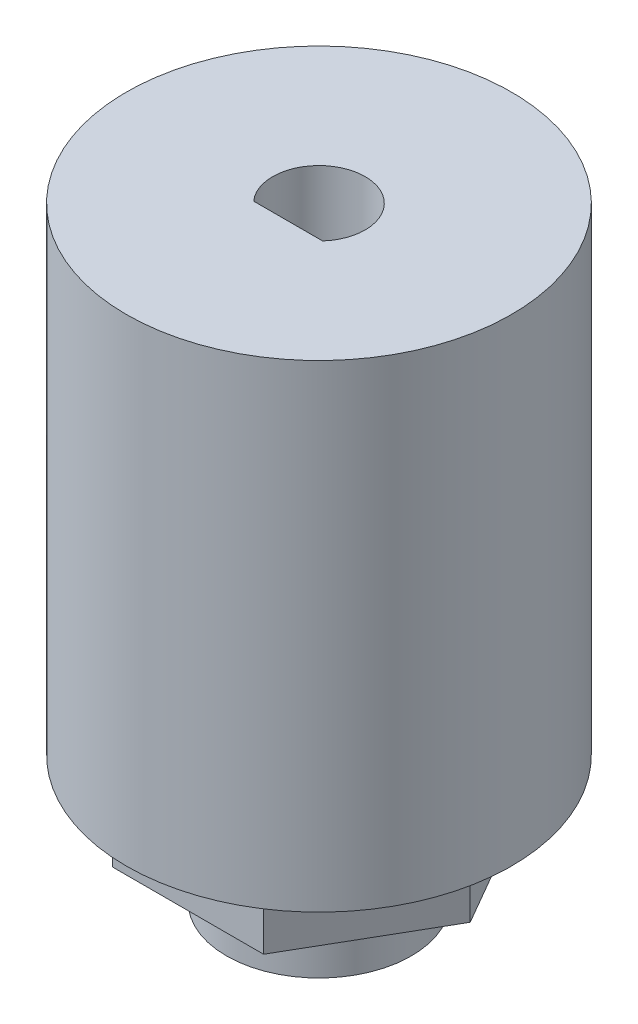
ISO-10303-21;
HEADER;
FILE_DESCRIPTION(('STEP AP214'),'2;1');
FILE_NAME('part.step','',(''),(''),'','','');
FILE_SCHEMA(('AUTOMOTIVE_DESIGN { 1 0 10303 214 1 1 1 1 }'));
ENDSEC;
DATA;
#1=APPLICATION_CONTEXT('core data for automotive mechanical design processes');
#2=APPLICATION_PROTOCOL_DEFINITION('international standard','automotive_design',2000,#1);
#3=PRODUCT_CONTEXT('',#1,'mechanical');
#4=PRODUCT('Part','Part','',(#3));
#5=PRODUCT_RELATED_PRODUCT_CATEGORY('part','',(#4));
#6=PRODUCT_DEFINITION_FORMATION('','',#4);
#7=PRODUCT_DEFINITION_CONTEXT('part definition',#1,'design');
#8=PRODUCT_DEFINITION('design','',#6,#7);
#9=PRODUCT_DEFINITION_SHAPE('','',#8);
#10=(LENGTH_UNIT() NAMED_UNIT(*) SI_UNIT(.MILLI.,.METRE.));
#11=(NAMED_UNIT(*) PLANE_ANGLE_UNIT() SI_UNIT($,.RADIAN.));
#12=(NAMED_UNIT(*) SI_UNIT($,.STERADIAN.) SOLID_ANGLE_UNIT());
#13=UNCERTAINTY_MEASURE_WITH_UNIT(LENGTH_MEASURE(1.E-05),#10,'distance_accuracy_value','');
#14=(GEOMETRIC_REPRESENTATION_CONTEXT(3) GLOBAL_UNCERTAINTY_ASSIGNED_CONTEXT((#13)) GLOBAL_UNIT_ASSIGNED_CONTEXT((#10,
#11,#12)) REPRESENTATION_CONTEXT('',''));
#15=CARTESIAN_POINT('',(0.,0.,0.));
#16=DIRECTION('',(0.,0.,1.));
#17=DIRECTION('',(1.,0.,0.));
#18=AXIS2_PLACEMENT_3D('',#15,#16,#17);
#19=CARTESIAN_POINT('',(0.,0.,2.));
#20=DIRECTION('',(0.,0.,1.));
#21=DIRECTION('',(1.,0.,0.));
#22=AXIS2_PLACEMENT_3D('',#19,#20,#21);
#23=PLANE('',#22);
#24=DIRECTION('',(1.,0.,0.));
#25=VECTOR('',#24,1.);
#26=CARTESIAN_POINT('',(0.,6.,2.));
#27=LINE('',#26,#25);
#28=CARTESIAN_POINT('',(-2.23606797749979,6.,2.));
#29=VERTEX_POINT('',#28);
#30=CARTESIAN_POINT('',(2.23606797749979,6.,2.));
#31=VERTEX_POINT('',#30);
#32=EDGE_CURVE('E51',#29,#31,#27,.T.);
#33=ORIENTED_EDGE('',*,*,#32,.F.);
#34=DIRECTION('',(0.,1.,0.));
#35=VECTOR('',#34,1.);
#36=CARTESIAN_POINT('',(-2.23606797749979,0.,2.));
#37=LINE('',#36,#35);
#38=CARTESIAN_POINT('',(-2.23606797749979,39.3,2.));
#39=VERTEX_POINT('',#38);
#40=EDGE_CURVE('E103',#29,#39,#37,.T.);
#41=ORIENTED_EDGE('',*,*,#40,.T.);
#42=DIRECTION('',(1.,0.,0.));
#43=VECTOR('',#42,1.);
#44=CARTESIAN_POINT('',(0.,39.3,2.));
#45=LINE('',#44,#43);
#46=CARTESIAN_POINT('',(2.23606797749979,39.3,2.));
#47=VERTEX_POINT('',#46);
#48=EDGE_CURVE('E104',#39,#47,#45,.T.);
#49=ORIENTED_EDGE('',*,*,#48,.T.);
#50=DIRECTION('',(0.,1.,0.));
#51=VECTOR('',#50,1.);
#52=CARTESIAN_POINT('',(2.23606797749979,0.,2.));
#53=LINE('',#52,#51);
#54=EDGE_CURVE('E58',#31,#47,#53,.T.);
#55=ORIENTED_EDGE('',*,*,#54,.F.);
#56=EDGE_LOOP('',(#33,#41,#49,#55));
#57=FACE_BOUND('',#56,.T.);
#58=ADVANCED_FACE('F38',(#57),#23,.F.);
#59=CARTESIAN_POINT('',(0.,0.,0.));
#60=DIRECTION('',(0.,1.,0.));
#61=DIRECTION('',(0.,0.,1.));
#62=AXIS2_PLACEMENT_3D('',#59,#60,#61);
#63=CYLINDRICAL_SURFACE('',#62,3.);
#64=CARTESIAN_POINT('',(0.,6.,0.));
#65=DIRECTION('',(0.,-1.,0.));
#66=DIRECTION('',(0.,0.,-1.));
#67=AXIS2_PLACEMENT_3D('',#64,#65,#66);
#68=CIRCLE('',#67,3.);
#69=EDGE_CURVE('E11',#31,#29,#68,.F.);
#70=ORIENTED_EDGE('',*,*,#69,.F.);
#71=ORIENTED_EDGE('',*,*,#54,.T.);
#72=CARTESIAN_POINT('',(0.,39.3,0.));
#73=DIRECTION('',(0.,1.,0.));
#74=DIRECTION('',(0.,0.,1.));
#75=AXIS2_PLACEMENT_3D('',#72,#73,#74);
#76=CIRCLE('',#75,3.);
#77=EDGE_CURVE('E109',#47,#39,#76,.T.);
#78=ORIENTED_EDGE('',*,*,#77,.T.);
#79=ORIENTED_EDGE('',*,*,#40,.F.);
#80=EDGE_LOOP('',(#70,#71,#78,#79));
#81=FACE_BOUND('',#80,.T.);
#82=ADVANCED_FACE('F107',(#81),#63,.F.);
#83=CARTESIAN_POINT('',(0.,3.8,0.));
#84=DIRECTION('',(0.,-1.,0.));
#85=DIRECTION('',(0.,0.,-1.));
#86=AXIS2_PLACEMENT_3D('',#83,#84,#85);
#87=CYLINDRICAL_SURFACE('',#86,6.);
#88=CARTESIAN_POINT('',(0.,3.8,0.));
#89=DIRECTION('',(0.,1.,0.));
#90=DIRECTION('',(0.,0.,1.));
#91=AXIS2_PLACEMENT_3D('',#88,#89,#90);
#92=CIRCLE('',#91,6.);
#93=CARTESIAN_POINT('',(0.,3.8,6.));
#94=VERTEX_POINT('',#93);
#95=EDGE_CURVE('E46',#94,#94,#92,.T.);
#96=ORIENTED_EDGE('',*,*,#95,.F.);
#97=EDGE_LOOP('',(#96));
#98=FACE_BOUND('',#97,.T.);
#99=CARTESIAN_POINT('',(0.,0.,0.));
#100=DIRECTION('',(0.,1.,0.));
#101=DIRECTION('',(0.,0.,1.));
#102=AXIS2_PLACEMENT_3D('',#99,#100,#101);
#103=CIRCLE('',#102,6.);
#104=CARTESIAN_POINT('',(0.,0.,6.));
#105=VERTEX_POINT('',#104);
#106=EDGE_CURVE('E171',#105,#105,#103,.T.);
#107=ORIENTED_EDGE('',*,*,#106,.T.);
#108=EDGE_LOOP('',(#107));
#109=FACE_BOUND('',#108,.T.);
#110=ADVANCED_FACE('F40',(#98,#109),#87,.T.);
#111=CARTESIAN_POINT('',(0.,0.,0.));
#112=DIRECTION('',(0.,1.,0.));
#113=DIRECTION('',(0.,0.,1.));
#114=AXIS2_PLACEMENT_3D('',#111,#112,#113);
#115=PLANE('',#114);
#116=CARTESIAN_POINT('',(0.,0.,0.));
#117=DIRECTION('',(0.,-1.,0.));
#118=DIRECTION('',(0.,0.,-1.));
#119=AXIS2_PLACEMENT_3D('',#116,#117,#118);
#120=CIRCLE('',#119,3.6);
#121=CARTESIAN_POINT('',(0.,0.,-3.6));
#122=VERTEX_POINT('',#121);
#123=EDGE_CURVE('E382',#122,#122,#120,.T.);
#124=ORIENTED_EDGE('',*,*,#123,.F.);
#125=EDGE_LOOP('',(#124));
#126=FACE_BOUND('',#125,.T.);
#127=ORIENTED_EDGE('',*,*,#106,.F.);
#128=EDGE_LOOP('',(#127));
#129=FACE_BOUND('',#128,.T.);
#130=ADVANCED_FACE('F177',(#126,#129),#115,.F.);
#131=CARTESIAN_POINT('',(4.90747728811182,8.3,8.5));
#132=DIRECTION('',(-0.866025403784439,0.,-0.5));
#133=DIRECTION('',(-0.5,0.,0.866025403784439));
#134=AXIS2_PLACEMENT_3D('',#131,#132,#133);
#135=PLANE('',#134);
#136=DIRECTION('',(0.5,0.,-0.866025403784439));
#137=VECTOR('',#136,1.);
#138=CARTESIAN_POINT('',(4.90747728811182,3.8,8.5));
#139=LINE('',#138,#137);
#140=CARTESIAN_POINT('',(4.90747728811182,3.8,8.5));
#141=VERTEX_POINT('',#140);
#142=CARTESIAN_POINT('',(9.81495457622364,3.8,0.));
#143=VERTEX_POINT('',#142);
#144=EDGE_CURVE('E122',#141,#143,#139,.T.);
#145=ORIENTED_EDGE('',*,*,#144,.T.);
#146=DIRECTION('',(0.,-1.,0.));
#147=VECTOR('',#146,1.);
#148=CARTESIAN_POINT('',(9.81495457622364,8.3,0.));
#149=LINE('',#148,#147);
#150=CARTESIAN_POINT('',(9.81495457622364,8.3,0.));
#151=VERTEX_POINT('',#150);
#152=EDGE_CURVE('E168',#151,#143,#149,.T.);
#153=ORIENTED_EDGE('',*,*,#152,.F.);
#154=DIRECTION('',(0.5,0.,-0.866025403784439));
#155=VECTOR('',#154,1.);
#156=CARTESIAN_POINT('',(4.90747728811182,8.3,8.5));
#157=LINE('',#156,#155);
#158=CARTESIAN_POINT('',(4.90747728811182,8.3,8.5));
#159=VERTEX_POINT('',#158);
#160=EDGE_CURVE('E123',#159,#151,#157,.T.);
#161=ORIENTED_EDGE('',*,*,#160,.F.);
#162=DIRECTION('',(0.,-1.,0.));
#163=VECTOR('',#162,1.);
#164=CARTESIAN_POINT('',(4.90747728811182,8.3,8.5));
#165=LINE('',#164,#163);
#166=EDGE_CURVE('E142',#159,#141,#165,.T.);
#167=ORIENTED_EDGE('',*,*,#166,.T.);
#168=EDGE_LOOP('',(#145,#153,#161,#167));
#169=FACE_BOUND('',#168,.T.);
#170=ADVANCED_FACE('F179',(#169),#135,.F.);
#171=CARTESIAN_POINT('',(9.81495457622364,8.3,0.));
#172=DIRECTION('',(-0.866025403784439,0.,0.5));
#173=DIRECTION('',(0.5,0.,0.866025403784439));
#174=AXIS2_PLACEMENT_3D('',#171,#172,#173);
#175=PLANE('',#174);
#176=DIRECTION('',(-0.5,0.,-0.866025403784439));
#177=VECTOR('',#176,1.);
#178=CARTESIAN_POINT('',(9.81495457622364,3.8,0.));
#179=LINE('',#178,#177);
#180=CARTESIAN_POINT('',(4.90747728811182,3.8,-8.5));
#181=VERTEX_POINT('',#180);
#182=EDGE_CURVE('E145',#143,#181,#179,.T.);
#183=ORIENTED_EDGE('',*,*,#182,.T.);
#184=DIRECTION('',(0.,-1.,0.));
#185=VECTOR('',#184,1.);
#186=CARTESIAN_POINT('',(4.90747728811182,8.3,-8.5));
#187=LINE('',#186,#185);
#188=CARTESIAN_POINT('',(4.90747728811182,8.3,-8.5));
#189=VERTEX_POINT('',#188);
#190=EDGE_CURVE('E165',#189,#181,#187,.T.);
#191=ORIENTED_EDGE('',*,*,#190,.F.);
#192=DIRECTION('',(-0.5,0.,-0.866025403784439));
#193=VECTOR('',#192,1.);
#194=CARTESIAN_POINT('',(9.81495457622364,8.3,0.));
#195=LINE('',#194,#193);
#196=EDGE_CURVE('E126',#151,#189,#195,.T.);
#197=ORIENTED_EDGE('',*,*,#196,.F.);
#198=ORIENTED_EDGE('',*,*,#152,.T.);
#199=EDGE_LOOP('',(#183,#191,#197,#198));
#200=FACE_BOUND('',#199,.T.);
#201=ADVANCED_FACE('F185',(#200),#175,.F.);
#202=CARTESIAN_POINT('',(4.90747728811182,8.3,-8.5));
#203=DIRECTION('',(0.,0.,1.));
#204=DIRECTION('',(1.,0.,0.));
#205=AXIS2_PLACEMENT_3D('',#202,#203,#204);
#206=PLANE('',#205);
#207=DIRECTION('',(-1.,0.,0.));
#208=VECTOR('',#207,1.);
#209=CARTESIAN_POINT('',(4.90747728811182,3.8,-8.5));
#210=LINE('',#209,#208);
#211=CARTESIAN_POINT('',(-4.90747728811182,3.8,-8.5));
#212=VERTEX_POINT('',#211);
#213=EDGE_CURVE('E147',#181,#212,#210,.T.);
#214=ORIENTED_EDGE('',*,*,#213,.T.);
#215=DIRECTION('',(0.,-1.,0.));
#216=VECTOR('',#215,1.);
#217=CARTESIAN_POINT('',(-4.90747728811182,8.3,-8.5));
#218=LINE('',#217,#216);
#219=CARTESIAN_POINT('',(-4.90747728811182,8.3,-8.5));
#220=VERTEX_POINT('',#219);
#221=EDGE_CURVE('E162',#220,#212,#218,.T.);
#222=ORIENTED_EDGE('',*,*,#221,.F.);
#223=DIRECTION('',(-1.,0.,0.));
#224=VECTOR('',#223,1.);
#225=CARTESIAN_POINT('',(4.90747728811182,8.3,-8.5));
#226=LINE('',#225,#224);
#227=EDGE_CURVE('E130',#189,#220,#226,.T.);
#228=ORIENTED_EDGE('',*,*,#227,.F.);
#229=ORIENTED_EDGE('',*,*,#190,.T.);
#230=EDGE_LOOP('',(#214,#222,#228,#229));
#231=FACE_BOUND('',#230,.T.);
#232=ADVANCED_FACE('F225',(#231),#206,.F.);
#233=CARTESIAN_POINT('',(-4.90747728811182,8.3,-8.5));
#234=DIRECTION('',(0.866025403784439,0.,0.5));
#235=DIRECTION('',(0.5,0.,-0.866025403784439));
#236=AXIS2_PLACEMENT_3D('',#233,#234,#235);
#237=PLANE('',#236);
#238=DIRECTION('',(-0.5,0.,0.866025403784439));
#239=VECTOR('',#238,1.);
#240=CARTESIAN_POINT('',(-4.90747728811182,3.8,-8.5));
#241=LINE('',#240,#239);
#242=CARTESIAN_POINT('',(-9.81495457622364,3.8,0.));
#243=VERTEX_POINT('',#242);
#244=EDGE_CURVE('E149',#212,#243,#241,.T.);
#245=ORIENTED_EDGE('',*,*,#244,.T.);
#246=DIRECTION('',(0.,-1.,0.));
#247=VECTOR('',#246,1.);
#248=CARTESIAN_POINT('',(-9.81495457622364,8.3,0.));
#249=LINE('',#248,#247);
#250=CARTESIAN_POINT('',(-9.81495457622364,8.3,0.));
#251=VERTEX_POINT('',#250);
#252=EDGE_CURVE('E159',#251,#243,#249,.T.);
#253=ORIENTED_EDGE('',*,*,#252,.F.);
#254=DIRECTION('',(-0.5,0.,0.866025403784439));
#255=VECTOR('',#254,1.);
#256=CARTESIAN_POINT('',(-4.90747728811182,8.3,-8.5));
#257=LINE('',#256,#255);
#258=EDGE_CURVE('E133',#220,#251,#257,.T.);
#259=ORIENTED_EDGE('',*,*,#258,.F.);
#260=ORIENTED_EDGE('',*,*,#221,.T.);
#261=EDGE_LOOP('',(#245,#253,#259,#260));
#262=FACE_BOUND('',#261,.T.);
#263=ADVANCED_FACE('F221',(#262),#237,.F.);
#264=CARTESIAN_POINT('',(-9.81495457622364,8.3,0.));
#265=DIRECTION('',(0.866025403784439,0.,-0.5));
#266=DIRECTION('',(-0.5,0.,-0.866025403784439));
#267=AXIS2_PLACEMENT_3D('',#264,#265,#266);
#268=PLANE('',#267);
#269=DIRECTION('',(0.5,0.,0.866025403784439));
#270=VECTOR('',#269,1.);
#271=CARTESIAN_POINT('',(-9.81495457622364,3.8,0.));
#272=LINE('',#271,#270);
#273=CARTESIAN_POINT('',(-4.90747728811182,3.8,8.5));
#274=VERTEX_POINT('',#273);
#275=EDGE_CURVE('E151',#243,#274,#272,.T.);
#276=ORIENTED_EDGE('',*,*,#275,.T.);
#277=DIRECTION('',(0.,-1.,0.));
#278=VECTOR('',#277,1.);
#279=CARTESIAN_POINT('',(-4.90747728811182,8.3,8.5));
#280=LINE('',#279,#278);
#281=CARTESIAN_POINT('',(-4.90747728811182,8.3,8.5));
#282=VERTEX_POINT('',#281);
#283=EDGE_CURVE('E156',#282,#274,#280,.T.);
#284=ORIENTED_EDGE('',*,*,#283,.F.);
#285=DIRECTION('',(0.5,0.,0.866025403784439));
#286=VECTOR('',#285,1.);
#287=CARTESIAN_POINT('',(-9.81495457622364,8.3,0.));
#288=LINE('',#287,#286);
#289=EDGE_CURVE('E136',#251,#282,#288,.T.);
#290=ORIENTED_EDGE('',*,*,#289,.F.);
#291=ORIENTED_EDGE('',*,*,#252,.T.);
#292=EDGE_LOOP('',(#276,#284,#290,#291));
#293=FACE_BOUND('',#292,.T.);
#294=ADVANCED_FACE('F217',(#293),#268,.F.);
#295=CARTESIAN_POINT('',(-4.90747728811182,8.3,8.5));
#296=DIRECTION('',(0.,0.,-1.));
#297=DIRECTION('',(-1.,0.,0.));
#298=AXIS2_PLACEMENT_3D('',#295,#296,#297);
#299=PLANE('',#298);
#300=DIRECTION('',(1.,0.,0.));
#301=VECTOR('',#300,1.);
#302=CARTESIAN_POINT('',(-4.90747728811182,3.8,8.5));
#303=LINE('',#302,#301);
#304=EDGE_CURVE('E127',#274,#141,#303,.T.);
#305=ORIENTED_EDGE('',*,*,#304,.T.);
#306=ORIENTED_EDGE('',*,*,#166,.F.);
#307=DIRECTION('',(1.,0.,0.));
#308=VECTOR('',#307,1.);
#309=CARTESIAN_POINT('',(-4.90747728811182,8.3,8.5));
#310=LINE('',#309,#308);
#311=EDGE_CURVE('E139',#282,#159,#310,.T.);
#312=ORIENTED_EDGE('',*,*,#311,.F.);
#313=ORIENTED_EDGE('',*,*,#283,.T.);
#314=EDGE_LOOP('',(#305,#306,#312,#313));
#315=FACE_BOUND('',#314,.T.);
#316=ADVANCED_FACE('F213',(#315),#299,.F.);
#317=CARTESIAN_POINT('',(0.,3.8,0.));
#318=DIRECTION('',(0.,1.,0.));
#319=DIRECTION('',(0.,0.,1.));
#320=AXIS2_PLACEMENT_3D('',#317,#318,#319);
#321=PLANE('',#320);
#322=ORIENTED_EDGE('',*,*,#95,.T.);
#323=EDGE_LOOP('',(#322));
#324=FACE_BOUND('',#323,.T.);
#325=ORIENTED_EDGE('',*,*,#144,.F.);
#326=ORIENTED_EDGE('',*,*,#304,.F.);
#327=ORIENTED_EDGE('',*,*,#275,.F.);
#328=ORIENTED_EDGE('',*,*,#244,.F.);
#329=ORIENTED_EDGE('',*,*,#213,.F.);
#330=ORIENTED_EDGE('',*,*,#182,.F.);
#331=EDGE_LOOP('',(#325,#326,#327,#328,#329,#330));
#332=FACE_BOUND('',#331,.T.);
#333=ADVANCED_FACE('F206',(#324,#332),#321,.F.);
#334=CARTESIAN_POINT('',(0.,8.3,0.));
#335=DIRECTION('',(0.,1.,0.));
#336=DIRECTION('',(0.,0.,1.));
#337=AXIS2_PLACEMENT_3D('',#334,#335,#336);
#338=PLANE('',#337);
#339=CARTESIAN_POINT('',(0.,8.3,0.));
#340=DIRECTION('',(0.,1.,0.));
#341=DIRECTION('',(0.,0.,1.));
#342=AXIS2_PLACEMENT_3D('',#339,#340,#341);
#343=CIRCLE('',#342,12.5);
#344=CARTESIAN_POINT('',(0.,8.3,12.5));
#345=VERTEX_POINT('',#344);
#346=EDGE_CURVE('E114',#345,#345,#343,.T.);
#347=ORIENTED_EDGE('',*,*,#346,.F.);
#348=EDGE_LOOP('',(#347));
#349=FACE_BOUND('',#348,.T.);
#350=ORIENTED_EDGE('',*,*,#311,.T.);
#351=ORIENTED_EDGE('',*,*,#160,.T.);
#352=ORIENTED_EDGE('',*,*,#196,.T.);
#353=ORIENTED_EDGE('',*,*,#227,.T.);
#354=ORIENTED_EDGE('',*,*,#258,.T.);
#355=ORIENTED_EDGE('',*,*,#289,.T.);
#356=EDGE_LOOP('',(#350,#351,#352,#353,#354,#355));
#357=FACE_BOUND('',#356,.T.);
#358=ADVANCED_FACE('F203',(#349,#357),#338,.F.);
#359=CARTESIAN_POINT('',(0.,12.3,0.));
#360=DIRECTION('',(0.,-1.,0.));
#361=DIRECTION('',(0.,0.,-1.));
#362=AXIS2_PLACEMENT_3D('',#359,#360,#361);
#363=CYLINDRICAL_SURFACE('',#362,12.5);
#364=ORIENTED_EDGE('',*,*,#346,.T.);
#365=EDGE_LOOP('',(#364));
#366=FACE_BOUND('',#365,.T.);
#367=CARTESIAN_POINT('',(0.,39.3,0.));
#368=DIRECTION('',(0.,1.,0.));
#369=DIRECTION('',(0.,0.,1.));
#370=AXIS2_PLACEMENT_3D('',#367,#368,#369);
#371=CIRCLE('',#370,12.5);
#372=CARTESIAN_POINT('',(0.,39.3,12.5));
#373=VERTEX_POINT('',#372);
#374=EDGE_CURVE('E111',#373,#373,#371,.T.);
#375=ORIENTED_EDGE('',*,*,#374,.F.);
#376=EDGE_LOOP('',(#375));
#377=FACE_BOUND('',#376,.T.);
#378=ADVANCED_FACE('F201',(#366,#377),#363,.T.);
#379=CARTESIAN_POINT('',(0.,39.3,0.));
#380=DIRECTION('',(0.,1.,0.));
#381=DIRECTION('',(0.,0.,1.));
#382=AXIS2_PLACEMENT_3D('',#379,#380,#381);
#383=PLANE('',#382);
#384=ORIENTED_EDGE('',*,*,#48,.F.);
#385=ORIENTED_EDGE('',*,*,#77,.F.);
#386=EDGE_LOOP('',(#384,#385));
#387=FACE_BOUND('',#386,.T.);
#388=ORIENTED_EDGE('',*,*,#374,.T.);
#389=EDGE_LOOP('',(#388));
#390=FACE_BOUND('',#389,.T.);
#391=ADVANCED_FACE('F198',(#387,#390),#383,.T.);
#392=CARTESIAN_POINT('',(0.,6.,0.));
#393=DIRECTION('',(0.,-1.,0.));
#394=DIRECTION('',(0.,0.,-1.));
#395=AXIS2_PLACEMENT_3D('',#392,#393,#394);
#396=PLANE('',#395);
#397=CARTESIAN_POINT('',(0.,6.,0.));
#398=DIRECTION('',(0.,-1.,0.));
#399=DIRECTION('',(0.,0.,-1.));
#400=AXIS2_PLACEMENT_3D('',#397,#398,#399);
#401=CIRCLE('',#400,3.6);
#402=CARTESIAN_POINT('',(0.,6.,-3.6));
#403=VERTEX_POINT('',#402);
#404=EDGE_CURVE('E105',#403,#403,#401,.T.);
#405=ORIENTED_EDGE('',*,*,#404,.T.);
#406=EDGE_LOOP('',(#405));
#407=FACE_BOUND('',#406,.T.);
#408=ORIENTED_EDGE('',*,*,#32,.T.);
#409=ORIENTED_EDGE('',*,*,#69,.T.);
#410=EDGE_LOOP('',(#408,#409));
#411=FACE_BOUND('',#410,.T.);
#412=ADVANCED_FACE('F100',(#407,#411),#396,.T.);
#413=CARTESIAN_POINT('',(0.,6.,0.));
#414=DIRECTION('',(0.,-1.,0.));
#415=DIRECTION('',(0.,0.,-1.));
#416=AXIS2_PLACEMENT_3D('',#413,#414,#415);
#417=CYLINDRICAL_SURFACE('',#416,3.6);
#418=ORIENTED_EDGE('',*,*,#404,.F.);
#419=EDGE_LOOP('',(#418));
#420=FACE_BOUND('',#419,.T.);
#421=ORIENTED_EDGE('',*,*,#123,.T.);
#422=EDGE_LOOP('',(#421));
#423=FACE_BOUND('',#422,.T.);
#424=ADVANCED_FACE('F288',(#420,#423),#417,.F.);
#425=CLOSED_SHELL('',(#58,#82,#110,#130,#170,#201,#232,#263,#294,#316,#333,#358,#378,#391,#412,#424));
#426=MANIFOLD_SOLID_BREP('B2',#425);
#427=ADVANCED_BREP_SHAPE_REPRESENTATION('',(#18,#426),#14);
#428=SHAPE_DEFINITION_REPRESENTATION(#9,#427);
ENDSEC;
END-ISO-10303-21;
